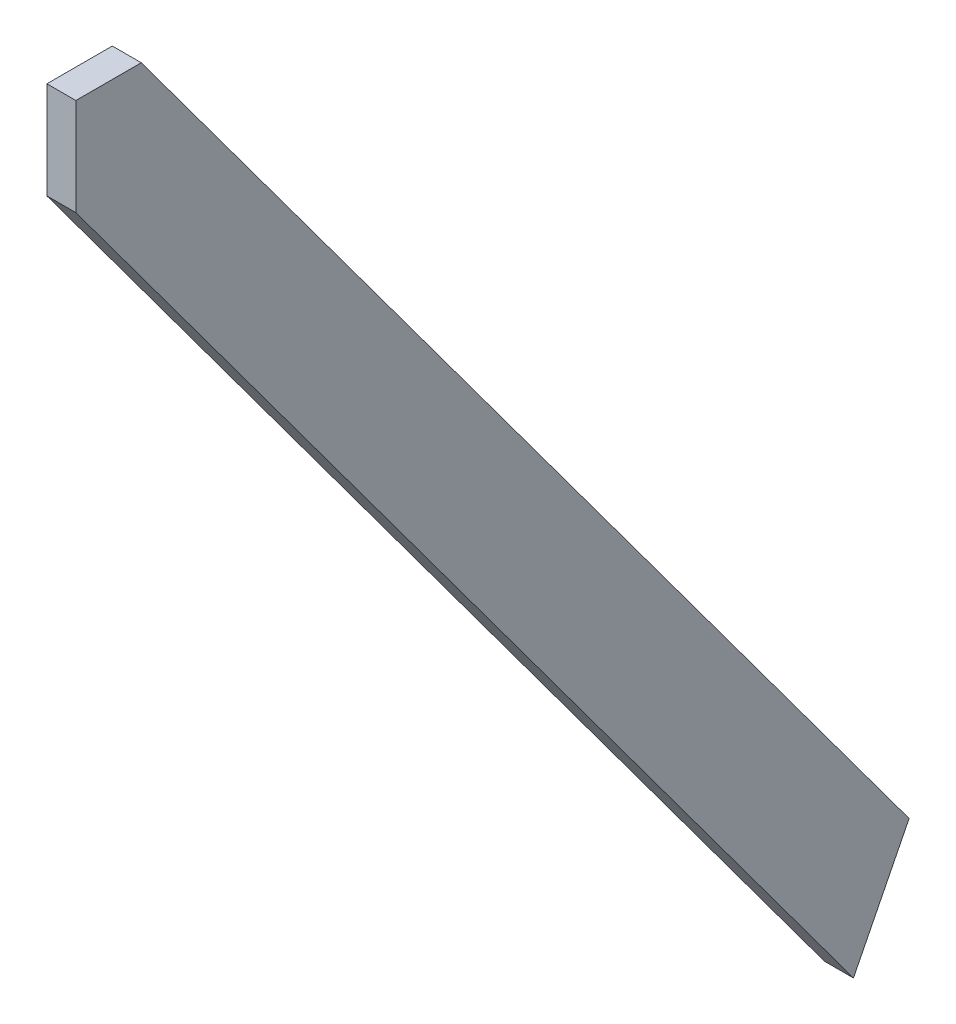
ISO-10303-21;
HEADER;
FILE_DESCRIPTION(('STEP AP214'),'2;1');
FILE_NAME('part.step','',(''),(''),'','','');
FILE_SCHEMA(('AUTOMOTIVE_DESIGN { 1 0 10303 214 1 1 1 1 }'));
ENDSEC;
DATA;
#1=APPLICATION_CONTEXT('core data for automotive mechanical design processes');
#2=APPLICATION_PROTOCOL_DEFINITION('international standard','automotive_design',2000,#1);
#3=PRODUCT_CONTEXT('',#1,'mechanical');
#4=PRODUCT('Part','Part','',(#3));
#5=PRODUCT_RELATED_PRODUCT_CATEGORY('part','',(#4));
#6=PRODUCT_DEFINITION_FORMATION('','',#4);
#7=PRODUCT_DEFINITION_CONTEXT('part definition',#1,'design');
#8=PRODUCT_DEFINITION('design','',#6,#7);
#9=PRODUCT_DEFINITION_SHAPE('','',#8);
#10=(LENGTH_UNIT() NAMED_UNIT(*) SI_UNIT(.MILLI.,.METRE.));
#11=(NAMED_UNIT(*) PLANE_ANGLE_UNIT() SI_UNIT($,.RADIAN.));
#12=(NAMED_UNIT(*) SI_UNIT($,.STERADIAN.) SOLID_ANGLE_UNIT());
#13=UNCERTAINTY_MEASURE_WITH_UNIT(LENGTH_MEASURE(1.E-05),#10,'distance_accuracy_value','');
#14=(GEOMETRIC_REPRESENTATION_CONTEXT(3) GLOBAL_UNCERTAINTY_ASSIGNED_CONTEXT((#13)) GLOBAL_UNIT_ASSIGNED_CONTEXT((#10,
#11,#12)) REPRESENTATION_CONTEXT('',''));
#15=CARTESIAN_POINT('',(0.,0.,0.));
#16=DIRECTION('',(0.,0.,1.));
#17=DIRECTION('',(1.,0.,0.));
#18=AXIS2_PLACEMENT_3D('',#15,#16,#17);
#19=CARTESIAN_POINT('',(2248.,2938.0811721534,2207.85848628738));
#20=DIRECTION('',(0.,-0.594550044513907,0.804058607670182));
#21=DIRECTION('',(0.,-0.804058607670182,-0.594550044513907));
#22=AXIS2_PLACEMENT_3D('',#19,#20,#21);
#23=PLANE('',#22);
#24=CARTESIAN_POINT('',(2269.,2654.039,1997.8274207816));
#25=CARTESIAN_POINT('',(2285.,2654.039,1997.8274207816));
#26=CARTESIAN_POINT('',(2285.,2670.039,2009.65840004291));
#27=CARTESIAN_POINT('',(2269.,2670.039,2009.65840004291));
#28=CARTESIAN_POINT('',(2253.,2670.039,2009.65840004291));
#29=CARTESIAN_POINT('',(2253.,2654.039,1997.8274207816));
#30=CARTESIAN_POINT('',(2269.,2654.039,1997.8274207816));
#31=(BOUNDED_CURVE() B_SPLINE_CURVE(3,(#24,#25,#26,#27,#28,#29,#30),.UNSPECIFIED.,.T.,
.F.) B_SPLINE_CURVE_WITH_KNOTS((4,3,4),(0.,0.5,1.),
.UNSPECIFIED.) CURVE() GEOMETRIC_REPRESENTATION_ITEM() RATIONAL_B_SPLINE_CURVE((1.,
0.333333333333333,0.333333333333333,1.,0.333333333333333,0.333333333333333,1.)) REPRESENTATION_ITEM(''));
#32=CARTESIAN_POINT('',(2269.,2654.039,1997.8274207816));
#33=VERTEX_POINT('',#32);
#34=EDGE_CURVE('E138',#33,#33,#31,.T.);
#35=ORIENTED_EDGE('',*,*,#34,.T.);
#36=EDGE_LOOP('',(#35));
#37=FACE_BOUND('',#36,.T.);
#38=CARTESIAN_POINT('',(2269.,2546.014,1917.94982486327));
#39=CARTESIAN_POINT('',(2285.,2546.014,1917.94982486327));
#40=CARTESIAN_POINT('',(2285.,2562.014,1929.78080412458));
#41=CARTESIAN_POINT('',(2269.,2562.014,1929.78080412458));
#42=CARTESIAN_POINT('',(2253.,2562.014,1929.78080412458));
#43=CARTESIAN_POINT('',(2253.,2546.014,1917.94982486327));
#44=CARTESIAN_POINT('',(2269.,2546.014,1917.94982486327));
#45=(BOUNDED_CURVE() B_SPLINE_CURVE(3,(#38,#39,#40,#41,#42,#43,#44),.UNSPECIFIED.,.T.,
.F.) B_SPLINE_CURVE_WITH_KNOTS((4,3,4),(0.,0.5,1.),
.UNSPECIFIED.) CURVE() GEOMETRIC_REPRESENTATION_ITEM() RATIONAL_B_SPLINE_CURVE((1.,
0.333333333333333,0.333333333333333,1.,0.333333333333333,0.333333333333333,1.)) REPRESENTATION_ITEM(''));
#46=CARTESIAN_POINT('',(2269.,2546.014,1917.94982486327));
#47=VERTEX_POINT('',#46);
#48=EDGE_CURVE('E256',#47,#47,#45,.T.);
#49=ORIENTED_EDGE('',*,*,#48,.T.);
#50=EDGE_LOOP('',(#49));
#51=FACE_BOUND('',#50,.T.);
#52=CARTESIAN_POINT('',(2269.,2419.4092,1824.33365216467));
#53=CARTESIAN_POINT('',(2285.,2419.4092,1824.33365216467));
#54=CARTESIAN_POINT('',(2285.,2435.4092,1836.16463142597));
#55=CARTESIAN_POINT('',(2269.,2435.4092,1836.16463142597));
#56=CARTESIAN_POINT('',(2253.,2435.4092,1836.16463142597));
#57=CARTESIAN_POINT('',(2253.,2419.4092,1824.33365216467));
#58=CARTESIAN_POINT('',(2269.,2419.4092,1824.33365216467));
#59=(BOUNDED_CURVE() B_SPLINE_CURVE(3,(#52,#53,#54,#55,#56,#57,#58),.UNSPECIFIED.,.T.,
.F.) B_SPLINE_CURVE_WITH_KNOTS((4,3,4),(0.,0.5,1.),
.UNSPECIFIED.) CURVE() GEOMETRIC_REPRESENTATION_ITEM() RATIONAL_B_SPLINE_CURVE((1.,
0.333333333333333,0.333333333333333,1.,0.333333333333333,0.333333333333333,1.)) REPRESENTATION_ITEM(''));
#60=CARTESIAN_POINT('',(2269.,2419.4092,1824.33365216467));
#61=VERTEX_POINT('',#60);
#62=EDGE_CURVE('E285',#61,#61,#59,.T.);
#63=ORIENTED_EDGE('',*,*,#62,.T.);
#64=EDGE_LOOP('',(#63));
#65=FACE_BOUND('',#64,.T.);
#66=CARTESIAN_POINT('',(2269.,2292.67805,1730.62405170104));
#67=CARTESIAN_POINT('',(2285.,2292.67805,1730.62405170104));
#68=CARTESIAN_POINT('',(2285.,2308.67805,1742.45503096235));
#69=CARTESIAN_POINT('',(2269.,2308.67805,1742.45503096235));
#70=CARTESIAN_POINT('',(2253.,2308.67805,1742.45503096235));
#71=CARTESIAN_POINT('',(2253.,2292.67805,1730.62405170104));
#72=CARTESIAN_POINT('',(2269.,2292.67805,1730.62405170104));
#73=(BOUNDED_CURVE() B_SPLINE_CURVE(3,(#66,#67,#68,#69,#70,#71,#72),.UNSPECIFIED.,.T.,
.F.) B_SPLINE_CURVE_WITH_KNOTS((4,3,4),(0.,0.5,1.),
.UNSPECIFIED.) CURVE() GEOMETRIC_REPRESENTATION_ITEM() RATIONAL_B_SPLINE_CURVE((1.,
0.333333333333333,0.333333333333333,1.,0.333333333333333,0.333333333333333,1.)) REPRESENTATION_ITEM(''));
#74=CARTESIAN_POINT('',(2269.,2292.67805,1730.62405170104));
#75=VERTEX_POINT('',#74);
#76=EDGE_CURVE('E303',#75,#75,#73,.T.);
#77=ORIENTED_EDGE('',*,*,#76,.T.);
#78=EDGE_LOOP('',(#77));
#79=FACE_BOUND('',#78,.T.);
#80=CARTESIAN_POINT('',(2269.,2166.07315,1637.0078050587));
#81=CARTESIAN_POINT('',(2285.,2166.07315,1637.0078050587));
#82=CARTESIAN_POINT('',(2285.,2182.07315,1648.83878432001));
#83=CARTESIAN_POINT('',(2269.,2182.07315,1648.83878432001));
#84=CARTESIAN_POINT('',(2253.,2182.07315,1648.83878432001));
#85=CARTESIAN_POINT('',(2253.,2166.07315,1637.0078050587));
#86=CARTESIAN_POINT('',(2269.,2166.07315,1637.0078050587));
#87=(BOUNDED_CURVE() B_SPLINE_CURVE(3,(#80,#81,#82,#83,#84,#85,#86),.UNSPECIFIED.,.T.,
.F.) B_SPLINE_CURVE_WITH_KNOTS((4,3,4),(0.,0.5,1.),
.UNSPECIFIED.) CURVE() GEOMETRIC_REPRESENTATION_ITEM() RATIONAL_B_SPLINE_CURVE((1.,
0.333333333333333,0.333333333333333,1.,0.333333333333333,0.333333333333333,1.)) REPRESENTATION_ITEM(''));
#88=CARTESIAN_POINT('',(2269.,2166.07315,1637.0078050587));
#89=VERTEX_POINT('',#88);
#90=EDGE_CURVE('E319',#89,#89,#87,.T.);
#91=ORIENTED_EDGE('',*,*,#90,.T.);
#92=EDGE_LOOP('',(#91));
#93=FACE_BOUND('',#92,.T.);
#94=CARTESIAN_POINT('',(2269.,2039.3422,1543.29835248255));
#95=CARTESIAN_POINT('',(2285.,2039.3422,1543.29835248255));
#96=CARTESIAN_POINT('',(2285.,2055.3422,1555.12933174386));
#97=CARTESIAN_POINT('',(2269.,2055.3422,1555.12933174386));
#98=CARTESIAN_POINT('',(2253.,2055.3422,1555.12933174386));
#99=CARTESIAN_POINT('',(2253.,2039.3422,1543.29835248255));
#100=CARTESIAN_POINT('',(2269.,2039.3422,1543.29835248255));
#101=(BOUNDED_CURVE() B_SPLINE_CURVE(3,(#94,#95,#96,#97,#98,#99,#100),.UNSPECIFIED.,.T.,
.F.) B_SPLINE_CURVE_WITH_KNOTS((4,3,4),(0.,0.5,1.),
.UNSPECIFIED.) CURVE() GEOMETRIC_REPRESENTATION_ITEM() RATIONAL_B_SPLINE_CURVE((1.,
0.333333333333333,0.333333333333333,1.,0.333333333333333,0.333333333333333,1.)) REPRESENTATION_ITEM(''));
#102=CARTESIAN_POINT('',(2269.,2039.3422,1543.29835248255));
#103=VERTEX_POINT('',#102);
#104=EDGE_CURVE('E335',#103,#103,#101,.T.);
#105=ORIENTED_EDGE('',*,*,#104,.T.);
#106=EDGE_LOOP('',(#105));
#107=FACE_BOUND('',#106,.T.);
#108=CARTESIAN_POINT('',(2269.,1912.7371,1449.68195795273));
#109=CARTESIAN_POINT('',(2285.,1912.7371,1449.68195795273));
#110=CARTESIAN_POINT('',(2285.,1928.7371,1461.51293721404));
#111=CARTESIAN_POINT('',(2269.,1928.7371,1461.51293721404));
#112=CARTESIAN_POINT('',(2253.,1928.7371,1461.51293721404));
#113=CARTESIAN_POINT('',(2253.,1912.7371,1449.68195795273));
#114=CARTESIAN_POINT('',(2269.,1912.7371,1449.68195795273));
#115=(BOUNDED_CURVE() B_SPLINE_CURVE(3,(#108,#109,#110,#111,#112,#113,#114),.UNSPECIFIED.,.T.,
.F.) B_SPLINE_CURVE_WITH_KNOTS((4,3,4),(0.,0.5,1.),
.UNSPECIFIED.) CURVE() GEOMETRIC_REPRESENTATION_ITEM() RATIONAL_B_SPLINE_CURVE((1.,
0.333333333333333,0.333333333333333,1.,0.333333333333333,0.333333333333333,1.)) REPRESENTATION_ITEM(''));
#116=CARTESIAN_POINT('',(2269.,1912.7371,1449.68195795273));
#117=VERTEX_POINT('',#116);
#118=EDGE_CURVE('E351',#117,#117,#115,.T.);
#119=ORIENTED_EDGE('',*,*,#118,.T.);
#120=EDGE_LOOP('',(#119));
#121=FACE_BOUND('',#120,.T.);
#122=CARTESIAN_POINT('',(2269.,1786.00615,1355.97250537658));
#123=CARTESIAN_POINT('',(2285.,1786.00615,1355.97250537658));
#124=CARTESIAN_POINT('',(2285.,1802.00615,1367.80348463789));
#125=CARTESIAN_POINT('',(2269.,1802.00615,1367.80348463789));
#126=CARTESIAN_POINT('',(2253.,1802.00615,1367.80348463789));
#127=CARTESIAN_POINT('',(2253.,1786.00615,1355.97250537658));
#128=CARTESIAN_POINT('',(2269.,1786.00615,1355.97250537658));
#129=(BOUNDED_CURVE() B_SPLINE_CURVE(3,(#122,#123,#124,#125,#126,#127,#128),.UNSPECIFIED.,.T.,
.F.) B_SPLINE_CURVE_WITH_KNOTS((4,3,4),(0.,0.5,1.),
.UNSPECIFIED.) CURVE() GEOMETRIC_REPRESENTATION_ITEM() RATIONAL_B_SPLINE_CURVE((1.,
0.333333333333333,0.333333333333333,1.,0.333333333333333,0.333333333333333,1.)) REPRESENTATION_ITEM(''));
#130=CARTESIAN_POINT('',(2269.,1786.00615,1355.97250537658));
#131=VERTEX_POINT('',#130);
#132=EDGE_CURVE('E367',#131,#131,#129,.T.);
#133=ORIENTED_EDGE('',*,*,#132,.T.);
#134=EDGE_LOOP('',(#133));
#135=FACE_BOUND('',#134,.T.);
#136=CARTESIAN_POINT('',(2269.,1659.4002,1262.35548232681));
#137=CARTESIAN_POINT('',(2285.,1659.4002,1262.35548232681));
#138=CARTESIAN_POINT('',(2285.,1675.4002,1274.18646158812));
#139=CARTESIAN_POINT('',(2269.,1675.4002,1274.18646158812));
#140=CARTESIAN_POINT('',(2253.,1675.4002,1274.18646158812));
#141=CARTESIAN_POINT('',(2253.,1659.4002,1262.35548232681));
#142=CARTESIAN_POINT('',(2269.,1659.4002,1262.35548232681));
#143=(BOUNDED_CURVE() B_SPLINE_CURVE(3,(#136,#137,#138,#139,#140,#141,#142),.UNSPECIFIED.,.T.,
.F.) B_SPLINE_CURVE_WITH_KNOTS((4,3,4),(0.,0.5,1.),
.UNSPECIFIED.) CURVE() GEOMETRIC_REPRESENTATION_ITEM() RATIONAL_B_SPLINE_CURVE((1.,
0.333333333333333,0.333333333333333,1.,0.333333333333333,0.333333333333333,1.)) REPRESENTATION_ITEM(''));
#144=CARTESIAN_POINT('',(2269.,1659.4002,1262.35548232681));
#145=VERTEX_POINT('',#144);
#146=EDGE_CURVE('E383',#145,#145,#143,.T.);
#147=ORIENTED_EDGE('',*,*,#146,.T.);
#148=EDGE_LOOP('',(#147));
#149=FACE_BOUND('',#148,.T.);
#150=CARTESIAN_POINT('',(2269.,1532.66905,1168.64588186318));
#151=CARTESIAN_POINT('',(2285.,1532.66905,1168.64588186318));
#152=CARTESIAN_POINT('',(2285.,1548.66905,1180.47686112449));
#153=CARTESIAN_POINT('',(2269.,1548.66905,1180.47686112449));
#154=CARTESIAN_POINT('',(2253.,1548.66905,1180.47686112449));
#155=CARTESIAN_POINT('',(2253.,1532.66905,1168.64588186318));
#156=CARTESIAN_POINT('',(2269.,1532.66905,1168.64588186318));
#157=(BOUNDED_CURVE() B_SPLINE_CURVE(3,(#150,#151,#152,#153,#154,#155,#156),.UNSPECIFIED.,.T.,
.F.) B_SPLINE_CURVE_WITH_KNOTS((4,3,4),(0.,0.5,1.),
.UNSPECIFIED.) CURVE() GEOMETRIC_REPRESENTATION_ITEM() RATIONAL_B_SPLINE_CURVE((1.,
0.333333333333333,0.333333333333333,1.,0.333333333333333,0.333333333333333,1.)) REPRESENTATION_ITEM(''));
#158=CARTESIAN_POINT('',(2269.,1532.66905,1168.64588186318));
#159=VERTEX_POINT('',#158);
#160=EDGE_CURVE('E399',#159,#159,#157,.T.);
#161=ORIENTED_EDGE('',*,*,#160,.T.);
#162=EDGE_LOOP('',(#161));
#163=FACE_BOUND('',#162,.T.);
#164=DIRECTION('',(0.,-0.804058607670182,-0.594550044513907));
#165=VECTOR('',#164,1.);
#166=CARTESIAN_POINT('',(2290.,2938.0811721534,2207.85848628738));
#167=LINE('',#166,#165);
#168=CARTESIAN_POINT('',(2290.,2938.0811721534,2207.85848628738));
#169=VERTEX_POINT('',#168);
#170=CARTESIAN_POINT('',(2290.,1432.3329,1094.4537));
#171=VERTEX_POINT('',#170);
#172=EDGE_CURVE('E123',#169,#171,#167,.T.);
#173=ORIENTED_EDGE('',*,*,#172,.T.);
#174=DIRECTION('',(1.,0.,0.));
#175=VECTOR('',#174,1.);
#176=CARTESIAN_POINT('',(2248.,1432.3329,1094.4537));
#177=LINE('',#176,#175);
#178=CARTESIAN_POINT('',(2248.,1432.3329,1094.4537));
#179=VERTEX_POINT('',#178);
#180=EDGE_CURVE('E11',#179,#171,#177,.T.);
#181=ORIENTED_EDGE('',*,*,#180,.F.);
#182=DIRECTION('',(0.,-0.804058607670182,-0.594550044513907));
#183=VECTOR('',#182,1.);
#184=CARTESIAN_POINT('',(2248.,2938.0811721534,2207.85848628738));
#185=LINE('',#184,#183);
#186=CARTESIAN_POINT('',(2248.,2938.0811721534,2207.85848628738));
#187=VERTEX_POINT('',#186);
#188=EDGE_CURVE('E119',#187,#179,#185,.T.);
#189=ORIENTED_EDGE('',*,*,#188,.F.);
#190=DIRECTION('',(1.,0.,0.));
#191=VECTOR('',#190,1.);
#192=CARTESIAN_POINT('',(2248.,2938.0811721534,2207.85848628738));
#193=LINE('',#192,#191);
#194=EDGE_CURVE('E116',#187,#169,#193,.T.);
#195=ORIENTED_EDGE('',*,*,#194,.T.);
#196=EDGE_LOOP('',(#173,#181,#189,#195));
#197=FACE_BOUND('',#196,.T.);
#198=ADVANCED_FACE('F40',(#37,#51,#65,#79,#93,#107,#121,#135,#149,#163,#197),#23,.F.);
#199=CARTESIAN_POINT('',(2248.,1432.3329,1094.4537));
#200=DIRECTION('',(0.,0.450251342651816,0.892901858235404));
#201=DIRECTION('',(0.,-0.892901858235404,0.450251342651816));
#202=AXIS2_PLACEMENT_3D('',#199,#200,#201);
#203=PLANE('',#202);
#204=DIRECTION('',(0.,-0.892901858235404,0.450251342651816));
#205=VECTOR('',#204,1.);
#206=CARTESIAN_POINT('',(2290.,1432.3329,1094.4537));
#207=LINE('',#206,#205);
#208=CARTESIAN_POINT('',(2290.,1272.3329,1175.1347));
#209=VERTEX_POINT('',#208);
#210=EDGE_CURVE('E127',#171,#209,#207,.T.);
#211=ORIENTED_EDGE('',*,*,#210,.T.);
#212=DIRECTION('',(1.,0.,0.));
#213=VECTOR('',#212,1.);
#214=CARTESIAN_POINT('',(2248.,1272.3329,1175.1347));
#215=LINE('',#214,#213);
#216=CARTESIAN_POINT('',(2248.,1272.3329,1175.1347));
#217=VERTEX_POINT('',#216);
#218=EDGE_CURVE('E48',#217,#209,#215,.T.);
#219=ORIENTED_EDGE('',*,*,#218,.F.);
#220=DIRECTION('',(0.,-0.892901858235404,0.450251342651816));
#221=VECTOR('',#220,1.);
#222=CARTESIAN_POINT('',(2248.,1432.3329,1094.4537));
#223=LINE('',#222,#221);
#224=EDGE_CURVE('E89',#179,#217,#223,.T.);
#225=ORIENTED_EDGE('',*,*,#224,.F.);
#226=ORIENTED_EDGE('',*,*,#180,.T.);
#227=EDGE_LOOP('',(#211,#219,#225,#226));
#228=FACE_BOUND('',#227,.T.);
#229=ADVANCED_FACE('F148',(#228),#203,.F.);
#230=CARTESIAN_POINT('',(2248.,1272.3329,1175.1347));
#231=DIRECTION('',(0.,0.594550011892989,-0.804058631791268));
#232=DIRECTION('',(0.,0.804058631791269,0.594550011892989));
#233=AXIS2_PLACEMENT_3D('',#230,#231,#232);
#234=PLANE('',#233);
#235=DIRECTION('',(0.,0.804058631791269,0.594550011892989));
#236=VECTOR('',#235,1.);
#237=CARTESIAN_POINT('',(2290.,1272.3329,1175.1347));
#238=LINE('',#237,#236);
#239=CARTESIAN_POINT('',(2290.,2797.2767556717,2302.7333));
#240=VERTEX_POINT('',#239);
#241=EDGE_CURVE('E109',#209,#240,#238,.T.);
#242=ORIENTED_EDGE('',*,*,#241,.T.);
#243=DIRECTION('',(1.,0.,0.));
#244=VECTOR('',#243,1.);
#245=CARTESIAN_POINT('',(2248.,2797.2767556717,2302.7333));
#246=LINE('',#245,#244);
#247=CARTESIAN_POINT('',(2248.,2797.2767556717,2302.7333));
#248=VERTEX_POINT('',#247);
#249=EDGE_CURVE('E55',#248,#240,#246,.T.);
#250=ORIENTED_EDGE('',*,*,#249,.F.);
#251=DIRECTION('',(0.,0.804058631791269,0.594550011892989));
#252=VECTOR('',#251,1.);
#253=CARTESIAN_POINT('',(2248.,1272.3329,1175.1347));
#254=LINE('',#253,#252);
#255=EDGE_CURVE('E107',#217,#248,#254,.T.);
#256=ORIENTED_EDGE('',*,*,#255,.F.);
#257=ORIENTED_EDGE('',*,*,#218,.T.);
#258=EDGE_LOOP('',(#242,#250,#256,#257));
#259=FACE_BOUND('',#258,.T.);
#260=ADVANCED_FACE('F105',(#259),#234,.F.);
#261=CARTESIAN_POINT('',(2248.,2938.0811721534,2207.85848628738));
#262=DIRECTION('',(0.,-1.,0.));
#263=DIRECTION('',(1.,0.,0.));
#264=AXIS2_PLACEMENT_3D('',#261,#262,#263);
#265=PLANE('',#264);
#266=DIRECTION('',(0.,0.,-1.));
#267=VECTOR('',#266,1.);
#268=CARTESIAN_POINT('',(2248.,2938.0811721534,2207.85848628738));
#269=LINE('',#268,#267);
#270=CARTESIAN_POINT('',(2248.,2938.0811721534,2302.7333));
#271=VERTEX_POINT('',#270);
#272=EDGE_CURVE('E64',#271,#187,#269,.T.);
#273=ORIENTED_EDGE('',*,*,#272,.F.);
#274=DIRECTION('',(1.,0.,0.));
#275=VECTOR('',#274,1.);
#276=CARTESIAN_POINT('',(2248.,2938.0811721534,2302.7333));
#277=LINE('',#276,#275);
#278=CARTESIAN_POINT('',(2290.,2938.0811721534,2302.7333));
#279=VERTEX_POINT('',#278);
#280=EDGE_CURVE('E98',#271,#279,#277,.T.);
#281=ORIENTED_EDGE('',*,*,#280,.T.);
#282=DIRECTION('',(0.,0.,-1.));
#283=VECTOR('',#282,1.);
#284=CARTESIAN_POINT('',(2290.,2938.0811721534,2207.85848628738));
#285=LINE('',#284,#283);
#286=EDGE_CURVE('E83',#279,#169,#285,.T.);
#287=ORIENTED_EDGE('',*,*,#286,.T.);
#288=ORIENTED_EDGE('',*,*,#194,.F.);
#289=EDGE_LOOP('',(#273,#281,#287,#288));
#290=FACE_BOUND('',#289,.T.);
#291=ADVANCED_FACE('F155',(#290),#265,.F.);
#292=CARTESIAN_POINT('',(2248.,0.,0.));
#293=DIRECTION('',(-1.,0.,0.));
#294=DIRECTION('',(0.,0.,1.));
#295=AXIS2_PLACEMENT_3D('',#292,#293,#294);
#296=PLANE('',#295);
#297=DIRECTION('',(0.,1.,0.));
#298=VECTOR('',#297,1.);
#299=CARTESIAN_POINT('',(2248.,2797.2767556717,2302.7333));
#300=LINE('',#299,#298);
#301=EDGE_CURVE('E96',#248,#271,#300,.T.);
#302=ORIENTED_EDGE('',*,*,#301,.T.);
#303=ORIENTED_EDGE('',*,*,#272,.T.);
#304=ORIENTED_EDGE('',*,*,#188,.T.);
#305=ORIENTED_EDGE('',*,*,#224,.T.);
#306=ORIENTED_EDGE('',*,*,#255,.T.);
#307=EDGE_LOOP('',(#302,#303,#304,#305,#306));
#308=FACE_BOUND('',#307,.T.);
#309=ADVANCED_FACE('F111',(#308),#296,.T.);
#310=CARTESIAN_POINT('',(2290.,0.,0.));
#311=DIRECTION('',(-1.,0.,0.));
#312=DIRECTION('',(0.,0.,1.));
#313=AXIS2_PLACEMENT_3D('',#310,#311,#312);
#314=PLANE('',#313);
#315=ORIENTED_EDGE('',*,*,#286,.F.);
#316=DIRECTION('',(0.,1.,0.));
#317=VECTOR('',#316,1.);
#318=CARTESIAN_POINT('',(2290.,2797.2767556717,2302.7333));
#319=LINE('',#318,#317);
#320=EDGE_CURVE('E100',#240,#279,#319,.T.);
#321=ORIENTED_EDGE('',*,*,#320,.F.);
#322=ORIENTED_EDGE('',*,*,#241,.F.);
#323=ORIENTED_EDGE('',*,*,#210,.F.);
#324=ORIENTED_EDGE('',*,*,#172,.F.);
#325=EDGE_LOOP('',(#315,#321,#322,#323,#324));
#326=FACE_BOUND('',#325,.T.);
#327=ADVANCED_FACE('F133',(#326),#314,.F.);
#328=CARTESIAN_POINT('',(2248.,2797.2767556717,2302.7333));
#329=DIRECTION('',(0.,0.,-1.));
#330=DIRECTION('',(-1.,0.,0.));
#331=AXIS2_PLACEMENT_3D('',#328,#329,#330);
#332=PLANE('',#331);
#333=ORIENTED_EDGE('',*,*,#320,.T.);
#334=ORIENTED_EDGE('',*,*,#280,.F.);
#335=ORIENTED_EDGE('',*,*,#301,.F.);
#336=ORIENTED_EDGE('',*,*,#249,.T.);
#337=EDGE_LOOP('',(#333,#334,#335,#336));
#338=FACE_BOUND('',#337,.T.);
#339=ADVANCED_FACE('F97',(#338),#332,.F.);
#340=CARTESIAN_POINT('',(2269.,1540.66905,1208.64588186318));
#341=DIRECTION('',(0.,0.,-1.));
#342=DIRECTION('',(-1.,0.,0.));
#343=AXIS2_PLACEMENT_3D('',#340,#341,#342);
#344=CYLINDRICAL_SURFACE('',#343,8.00000000000001);
#345=CARTESIAN_POINT('',(2269.,1532.66905,1208.64588186318));
#346=CARTESIAN_POINT('',(2285.,1532.66905,1208.64588186318));
#347=CARTESIAN_POINT('',(2285.,1548.66905,1220.47686112449));
#348=CARTESIAN_POINT('',(2269.,1548.66905,1220.47686112449));
#349=CARTESIAN_POINT('',(2253.,1548.66905,1220.47686112449));
#350=CARTESIAN_POINT('',(2253.,1532.66905,1208.64588186318));
#351=CARTESIAN_POINT('',(2269.,1532.66905,1208.64588186318));
#352=(BOUNDED_CURVE() B_SPLINE_CURVE(3,(#345,#346,#347,#348,#349,#350,#351),.UNSPECIFIED.,.T.,
.F.) B_SPLINE_CURVE_WITH_KNOTS((4,3,4),(0.,0.5,1.),
.UNSPECIFIED.) CURVE() GEOMETRIC_REPRESENTATION_ITEM() RATIONAL_B_SPLINE_CURVE((1.,
0.333333333333333,0.333333333333333,1.,0.333333333333333,0.333333333333333,1.)) REPRESENTATION_ITEM(''));
#353=CARTESIAN_POINT('',(2269.,1532.66905,1208.64588186318));
#354=VERTEX_POINT('',#353);
#355=EDGE_CURVE('E392',#354,#354,#352,.T.);
#356=ORIENTED_EDGE('',*,*,#355,.T.);
#357=EDGE_LOOP('',(#356));
#358=FACE_BOUND('',#357,.T.);
#359=ORIENTED_EDGE('',*,*,#160,.F.);
#360=EDGE_LOOP('',(#359));
#361=FACE_BOUND('',#360,.T.);
#362=ADVANCED_FACE('F168',(#358,#361),#344,.F.);
#363=CARTESIAN_POINT('',(2269.,1548.66905,1220.47686112449));
#364=DIRECTION('',(0.,0.594550044513899,-0.804058607670188));
#365=DIRECTION('',(0.,0.804058607670188,0.594550044513899));
#366=AXIS2_PLACEMENT_3D('',#363,#364,#365);
#367=PLANE('',#366);
#368=ORIENTED_EDGE('',*,*,#355,.F.);
#369=EDGE_LOOP('',(#368));
#370=FACE_BOUND('',#369,.T.);
#371=ADVANCED_FACE('F171',(#370),#367,.T.);
#372=CARTESIAN_POINT('',(2269.,1667.4002,1302.35548232681));
#373=DIRECTION('',(0.,0.,-1.));
#374=DIRECTION('',(-1.,0.,0.));
#375=AXIS2_PLACEMENT_3D('',#372,#373,#374);
#376=CYLINDRICAL_SURFACE('',#375,8.00000000000001);
#377=CARTESIAN_POINT('',(2269.,1659.4002,1302.35548232681));
#378=CARTESIAN_POINT('',(2285.,1659.4002,1302.35548232681));
#379=CARTESIAN_POINT('',(2285.,1675.4002,1314.18646158812));
#380=CARTESIAN_POINT('',(2269.,1675.4002,1314.18646158812));
#381=CARTESIAN_POINT('',(2253.,1675.4002,1314.18646158812));
#382=CARTESIAN_POINT('',(2253.,1659.4002,1302.35548232681));
#383=CARTESIAN_POINT('',(2269.,1659.4002,1302.35548232681));
#384=(BOUNDED_CURVE() B_SPLINE_CURVE(3,(#377,#378,#379,#380,#381,#382,#383),.UNSPECIFIED.,.T.,
.F.) B_SPLINE_CURVE_WITH_KNOTS((4,3,4),(0.,0.5,1.),
.UNSPECIFIED.) CURVE() GEOMETRIC_REPRESENTATION_ITEM() RATIONAL_B_SPLINE_CURVE((1.,
0.333333333333333,0.333333333333333,1.,0.333333333333333,0.333333333333333,1.)) REPRESENTATION_ITEM(''));
#385=CARTESIAN_POINT('',(2269.,1659.4002,1302.35548232681));
#386=VERTEX_POINT('',#385);
#387=EDGE_CURVE('E375',#386,#386,#384,.T.);
#388=ORIENTED_EDGE('',*,*,#387,.T.);
#389=EDGE_LOOP('',(#388));
#390=FACE_BOUND('',#389,.T.);
#391=ORIENTED_EDGE('',*,*,#146,.F.);
#392=EDGE_LOOP('',(#391));
#393=FACE_BOUND('',#392,.T.);
#394=ADVANCED_FACE('F175',(#390,#393),#376,.F.);
#395=CARTESIAN_POINT('',(2269.,1675.4002,1314.18646158812));
#396=DIRECTION('',(0.,0.594550044513899,-0.804058607670188));
#397=DIRECTION('',(0.,0.804058607670188,0.594550044513899));
#398=AXIS2_PLACEMENT_3D('',#395,#396,#397);
#399=PLANE('',#398);
#400=ORIENTED_EDGE('',*,*,#387,.F.);
#401=EDGE_LOOP('',(#400));
#402=FACE_BOUND('',#401,.T.);
#403=ADVANCED_FACE('F179',(#402),#399,.T.);
#404=CARTESIAN_POINT('',(2269.,1794.00615,1395.97250537658));
#405=DIRECTION('',(0.,0.,-1.));
#406=DIRECTION('',(-1.,0.,0.));
#407=AXIS2_PLACEMENT_3D('',#404,#405,#406);
#408=CYLINDRICAL_SURFACE('',#407,8.00000000000001);
#409=CARTESIAN_POINT('',(2269.,1786.00615,1395.97250537658));
#410=CARTESIAN_POINT('',(2285.,1786.00615,1395.97250537658));
#411=CARTESIAN_POINT('',(2285.,1802.00615,1407.80348463789));
#412=CARTESIAN_POINT('',(2269.,1802.00615,1407.80348463789));
#413=CARTESIAN_POINT('',(2253.,1802.00615,1407.80348463789));
#414=CARTESIAN_POINT('',(2253.,1786.00615,1395.97250537658));
#415=CARTESIAN_POINT('',(2269.,1786.00615,1395.97250537658));
#416=(BOUNDED_CURVE() B_SPLINE_CURVE(3,(#409,#410,#411,#412,#413,#414,#415),.UNSPECIFIED.,.T.,
.F.) B_SPLINE_CURVE_WITH_KNOTS((4,3,4),(0.,0.5,1.),
.UNSPECIFIED.) CURVE() GEOMETRIC_REPRESENTATION_ITEM() RATIONAL_B_SPLINE_CURVE((1.,
0.333333333333333,0.333333333333333,1.,0.333333333333333,0.333333333333333,1.)) REPRESENTATION_ITEM(''));
#417=CARTESIAN_POINT('',(2269.,1786.00615,1395.97250537658));
#418=VERTEX_POINT('',#417);
#419=EDGE_CURVE('E359',#418,#418,#416,.T.);
#420=ORIENTED_EDGE('',*,*,#419,.T.);
#421=EDGE_LOOP('',(#420));
#422=FACE_BOUND('',#421,.T.);
#423=ORIENTED_EDGE('',*,*,#132,.F.);
#424=EDGE_LOOP('',(#423));
#425=FACE_BOUND('',#424,.T.);
#426=ADVANCED_FACE('F183',(#422,#425),#408,.F.);
#427=CARTESIAN_POINT('',(2269.,1802.00615,1407.80348463789));
#428=DIRECTION('',(0.,0.594550044513894,-0.804058607670192));
#429=DIRECTION('',(0.,0.804058607670192,0.594550044513894));
#430=AXIS2_PLACEMENT_3D('',#427,#428,#429);
#431=PLANE('',#430);
#432=ORIENTED_EDGE('',*,*,#419,.F.);
#433=EDGE_LOOP('',(#432));
#434=FACE_BOUND('',#433,.T.);
#435=ADVANCED_FACE('F187',(#434),#431,.T.);
#436=CARTESIAN_POINT('',(2269.,1920.7371,1489.68195795273));
#437=DIRECTION('',(0.,0.,-1.));
#438=DIRECTION('',(-1.,0.,0.));
#439=AXIS2_PLACEMENT_3D('',#436,#437,#438);
#440=CYLINDRICAL_SURFACE('',#439,8.00000000000001);
#441=CARTESIAN_POINT('',(2269.,1912.7371,1489.68195795273));
#442=CARTESIAN_POINT('',(2285.,1912.7371,1489.68195795273));
#443=CARTESIAN_POINT('',(2285.,1928.7371,1501.51293721404));
#444=CARTESIAN_POINT('',(2269.,1928.7371,1501.51293721404));
#445=CARTESIAN_POINT('',(2253.,1928.7371,1501.51293721404));
#446=CARTESIAN_POINT('',(2253.,1912.7371,1489.68195795273));
#447=CARTESIAN_POINT('',(2269.,1912.7371,1489.68195795273));
#448=(BOUNDED_CURVE() B_SPLINE_CURVE(3,(#441,#442,#443,#444,#445,#446,#447),.UNSPECIFIED.,.T.,
.F.) B_SPLINE_CURVE_WITH_KNOTS((4,3,4),(0.,0.5,1.),
.UNSPECIFIED.) CURVE() GEOMETRIC_REPRESENTATION_ITEM() RATIONAL_B_SPLINE_CURVE((1.,
0.333333333333333,0.333333333333333,1.,0.333333333333333,0.333333333333333,1.)) REPRESENTATION_ITEM(''));
#449=CARTESIAN_POINT('',(2269.,1912.7371,1489.68195795273));
#450=VERTEX_POINT('',#449);
#451=EDGE_CURVE('E343',#450,#450,#448,.T.);
#452=ORIENTED_EDGE('',*,*,#451,.T.);
#453=EDGE_LOOP('',(#452));
#454=FACE_BOUND('',#453,.T.);
#455=ORIENTED_EDGE('',*,*,#118,.F.);
#456=EDGE_LOOP('',(#455));
#457=FACE_BOUND('',#456,.T.);
#458=ADVANCED_FACE('F191',(#454,#457),#440,.F.);
#459=CARTESIAN_POINT('',(2269.,1928.7371,1501.51293721404));
#460=DIRECTION('',(0.,0.594550044513894,-0.804058607670192));
#461=DIRECTION('',(0.,0.804058607670192,0.594550044513894));
#462=AXIS2_PLACEMENT_3D('',#459,#460,#461);
#463=PLANE('',#462);
#464=ORIENTED_EDGE('',*,*,#451,.F.);
#465=EDGE_LOOP('',(#464));
#466=FACE_BOUND('',#465,.T.);
#467=ADVANCED_FACE('F195',(#466),#463,.T.);
#468=CARTESIAN_POINT('',(2269.,2047.3422,1583.29835248255));
#469=DIRECTION('',(0.,0.,-1.));
#470=DIRECTION('',(-1.,0.,0.));
#471=AXIS2_PLACEMENT_3D('',#468,#469,#470);
#472=CYLINDRICAL_SURFACE('',#471,8.00000000000001);
#473=CARTESIAN_POINT('',(2269.,2039.3422,1583.29835248255));
#474=CARTESIAN_POINT('',(2285.,2039.3422,1583.29835248255));
#475=CARTESIAN_POINT('',(2285.,2055.3422,1595.12933174386));
#476=CARTESIAN_POINT('',(2269.,2055.3422,1595.12933174386));
#477=CARTESIAN_POINT('',(2253.,2055.3422,1595.12933174386));
#478=CARTESIAN_POINT('',(2253.,2039.3422,1583.29835248255));
#479=CARTESIAN_POINT('',(2269.,2039.3422,1583.29835248255));
#480=(BOUNDED_CURVE() B_SPLINE_CURVE(3,(#473,#474,#475,#476,#477,#478,#479),.UNSPECIFIED.,.T.,
.F.) B_SPLINE_CURVE_WITH_KNOTS((4,3,4),(0.,0.5,1.),
.UNSPECIFIED.) CURVE() GEOMETRIC_REPRESENTATION_ITEM() RATIONAL_B_SPLINE_CURVE((1.,
0.333333333333333,0.333333333333333,1.,0.333333333333333,0.333333333333333,1.)) REPRESENTATION_ITEM(''));
#481=CARTESIAN_POINT('',(2269.,2039.3422,1583.29835248255));
#482=VERTEX_POINT('',#481);
#483=EDGE_CURVE('E327',#482,#482,#480,.T.);
#484=ORIENTED_EDGE('',*,*,#483,.T.);
#485=EDGE_LOOP('',(#484));
#486=FACE_BOUND('',#485,.T.);
#487=ORIENTED_EDGE('',*,*,#104,.F.);
#488=EDGE_LOOP('',(#487));
#489=FACE_BOUND('',#488,.T.);
#490=ADVANCED_FACE('F199',(#486,#489),#472,.F.);
#491=CARTESIAN_POINT('',(2269.,2055.3422,1595.12933174386));
#492=DIRECTION('',(0.,0.594550044513899,-0.804058607670188));
#493=DIRECTION('',(0.,0.804058607670188,0.594550044513899));
#494=AXIS2_PLACEMENT_3D('',#491,#492,#493);
#495=PLANE('',#494);
#496=ORIENTED_EDGE('',*,*,#483,.F.);
#497=EDGE_LOOP('',(#496));
#498=FACE_BOUND('',#497,.T.);
#499=ADVANCED_FACE('F203',(#498),#495,.T.);
#500=CARTESIAN_POINT('',(2269.,2174.07315,1677.0078050587));
#501=DIRECTION('',(0.,0.,-1.));
#502=DIRECTION('',(-1.,0.,0.));
#503=AXIS2_PLACEMENT_3D('',#500,#501,#502);
#504=CYLINDRICAL_SURFACE('',#503,8.00000000000001);
#505=CARTESIAN_POINT('',(2269.,2166.07315,1677.0078050587));
#506=CARTESIAN_POINT('',(2285.,2166.07315,1677.0078050587));
#507=CARTESIAN_POINT('',(2285.,2182.07315,1688.83878432001));
#508=CARTESIAN_POINT('',(2269.,2182.07315,1688.83878432001));
#509=CARTESIAN_POINT('',(2253.,2182.07315,1688.83878432001));
#510=CARTESIAN_POINT('',(2253.,2166.07315,1677.0078050587));
#511=CARTESIAN_POINT('',(2269.,2166.07315,1677.0078050587));
#512=(BOUNDED_CURVE() B_SPLINE_CURVE(3,(#505,#506,#507,#508,#509,#510,#511),.UNSPECIFIED.,.T.,
.F.) B_SPLINE_CURVE_WITH_KNOTS((4,3,4),(0.,0.5,1.),
.UNSPECIFIED.) CURVE() GEOMETRIC_REPRESENTATION_ITEM() RATIONAL_B_SPLINE_CURVE((1.,
0.333333333333333,0.333333333333333,1.,0.333333333333333,0.333333333333333,1.)) REPRESENTATION_ITEM(''));
#513=CARTESIAN_POINT('',(2269.,2166.07315,1677.0078050587));
#514=VERTEX_POINT('',#513);
#515=EDGE_CURVE('E311',#514,#514,#512,.T.);
#516=ORIENTED_EDGE('',*,*,#515,.T.);
#517=EDGE_LOOP('',(#516));
#518=FACE_BOUND('',#517,.T.);
#519=ORIENTED_EDGE('',*,*,#90,.F.);
#520=EDGE_LOOP('',(#519));
#521=FACE_BOUND('',#520,.T.);
#522=ADVANCED_FACE('F207',(#518,#521),#504,.F.);
#523=CARTESIAN_POINT('',(2269.,2182.07315,1688.83878432001));
#524=DIRECTION('',(0.,0.594550044513899,-0.804058607670188));
#525=DIRECTION('',(0.,0.804058607670188,0.594550044513899));
#526=AXIS2_PLACEMENT_3D('',#523,#524,#525);
#527=PLANE('',#526);
#528=ORIENTED_EDGE('',*,*,#515,.F.);
#529=EDGE_LOOP('',(#528));
#530=FACE_BOUND('',#529,.T.);
#531=ADVANCED_FACE('F211',(#530),#527,.T.);
#532=CARTESIAN_POINT('',(2269.,2300.67805,1770.62405170104));
#533=DIRECTION('',(0.,0.,-1.));
#534=DIRECTION('',(-1.,0.,0.));
#535=AXIS2_PLACEMENT_3D('',#532,#533,#534);
#536=CYLINDRICAL_SURFACE('',#535,8.00000000000001);
#537=CARTESIAN_POINT('',(2269.,2292.67805,1770.62405170104));
#538=CARTESIAN_POINT('',(2285.,2292.67805,1770.62405170104));
#539=CARTESIAN_POINT('',(2285.,2308.67805,1782.45503096235));
#540=CARTESIAN_POINT('',(2269.,2308.67805,1782.45503096235));
#541=CARTESIAN_POINT('',(2253.,2308.67805,1782.45503096235));
#542=CARTESIAN_POINT('',(2253.,2292.67805,1770.62405170104));
#543=CARTESIAN_POINT('',(2269.,2292.67805,1770.62405170104));
#544=(BOUNDED_CURVE() B_SPLINE_CURVE(3,(#537,#538,#539,#540,#541,#542,#543),.UNSPECIFIED.,.T.,
.F.) B_SPLINE_CURVE_WITH_KNOTS((4,3,4),(0.,0.5,1.),
.UNSPECIFIED.) CURVE() GEOMETRIC_REPRESENTATION_ITEM() RATIONAL_B_SPLINE_CURVE((1.,
0.333333333333333,0.333333333333333,1.,0.333333333333333,0.333333333333333,1.)) REPRESENTATION_ITEM(''));
#545=CARTESIAN_POINT('',(2269.,2292.67805,1770.62405170104));
#546=VERTEX_POINT('',#545);
#547=EDGE_CURVE('E294',#546,#546,#544,.T.);
#548=ORIENTED_EDGE('',*,*,#547,.T.);
#549=EDGE_LOOP('',(#548));
#550=FACE_BOUND('',#549,.T.);
#551=ORIENTED_EDGE('',*,*,#76,.F.);
#552=EDGE_LOOP('',(#551));
#553=FACE_BOUND('',#552,.T.);
#554=ADVANCED_FACE('F215',(#550,#553),#536,.F.);
#555=CARTESIAN_POINT('',(2269.,2308.67805,1782.45503096235));
#556=DIRECTION('',(0.,0.594550044513899,-0.804058607670188));
#557=DIRECTION('',(0.,0.804058607670188,0.594550044513899));
#558=AXIS2_PLACEMENT_3D('',#555,#556,#557);
#559=PLANE('',#558);
#560=ORIENTED_EDGE('',*,*,#547,.F.);
#561=EDGE_LOOP('',(#560));
#562=FACE_BOUND('',#561,.T.);
#563=ADVANCED_FACE('F219',(#562),#559,.T.);
#564=CARTESIAN_POINT('',(2269.,2427.4092,1864.33365216467));
#565=DIRECTION('',(0.,0.,-1.));
#566=DIRECTION('',(-1.,0.,0.));
#567=AXIS2_PLACEMENT_3D('',#564,#565,#566);
#568=CYLINDRICAL_SURFACE('',#567,8.00000000000001);
#569=CARTESIAN_POINT('',(2269.,2419.4092,1864.33365216467));
#570=CARTESIAN_POINT('',(2285.,2419.4092,1864.33365216467));
#571=CARTESIAN_POINT('',(2285.,2435.4092,1876.16463142597));
#572=CARTESIAN_POINT('',(2269.,2435.4092,1876.16463142597));
#573=CARTESIAN_POINT('',(2253.,2435.4092,1876.16463142597));
#574=CARTESIAN_POINT('',(2253.,2419.4092,1864.33365216467));
#575=CARTESIAN_POINT('',(2269.,2419.4092,1864.33365216467));
#576=(BOUNDED_CURVE() B_SPLINE_CURVE(3,(#569,#570,#571,#572,#573,#574,#575),.UNSPECIFIED.,.T.,
.F.) B_SPLINE_CURVE_WITH_KNOTS((4,3,4),(0.,0.5,1.),
.UNSPECIFIED.) CURVE() GEOMETRIC_REPRESENTATION_ITEM() RATIONAL_B_SPLINE_CURVE((1.,
0.333333333333333,0.333333333333333,1.,0.333333333333333,0.333333333333333,1.)) REPRESENTATION_ITEM(''));
#577=CARTESIAN_POINT('',(2269.,2419.4092,1864.33365216467));
#578=VERTEX_POINT('',#577);
#579=EDGE_CURVE('E276',#578,#578,#576,.T.);
#580=ORIENTED_EDGE('',*,*,#579,.T.);
#581=EDGE_LOOP('',(#580));
#582=FACE_BOUND('',#581,.T.);
#583=ORIENTED_EDGE('',*,*,#62,.F.);
#584=EDGE_LOOP('',(#583));
#585=FACE_BOUND('',#584,.T.);
#586=ADVANCED_FACE('F223',(#582,#585),#568,.F.);
#587=CARTESIAN_POINT('',(2269.,2435.4092,1876.16463142597));
#588=DIRECTION('',(0.,0.594550044513899,-0.804058607670188));
#589=DIRECTION('',(0.,0.804058607670188,0.594550044513899));
#590=AXIS2_PLACEMENT_3D('',#587,#588,#589);
#591=PLANE('',#590);
#592=ORIENTED_EDGE('',*,*,#579,.F.);
#593=EDGE_LOOP('',(#592));
#594=FACE_BOUND('',#593,.T.);
#595=ADVANCED_FACE('F227',(#594),#591,.T.);
#596=CARTESIAN_POINT('',(2269.,2554.014,1957.94982486327));
#597=DIRECTION('',(0.,0.,-1.));
#598=DIRECTION('',(-1.,0.,0.));
#599=AXIS2_PLACEMENT_3D('',#596,#597,#598);
#600=CYLINDRICAL_SURFACE('',#599,8.00000000000001);
#601=CARTESIAN_POINT('',(2269.,2546.014,1957.94982486327));
#602=CARTESIAN_POINT('',(2285.,2546.014,1957.94982486327));
#603=CARTESIAN_POINT('',(2285.,2562.014,1969.78080412458));
#604=CARTESIAN_POINT('',(2269.,2562.014,1969.78080412458));
#605=CARTESIAN_POINT('',(2253.,2562.014,1969.78080412458));
#606=CARTESIAN_POINT('',(2253.,2546.014,1957.94982486327));
#607=CARTESIAN_POINT('',(2269.,2546.014,1957.94982486327));
#608=(BOUNDED_CURVE() B_SPLINE_CURVE(3,(#601,#602,#603,#604,#605,#606,#607),.UNSPECIFIED.,.T.,
.F.) B_SPLINE_CURVE_WITH_KNOTS((4,3,4),(0.,0.5,1.),
.UNSPECIFIED.) CURVE() GEOMETRIC_REPRESENTATION_ITEM() RATIONAL_B_SPLINE_CURVE((1.,
0.333333333333333,0.333333333333333,1.,0.333333333333333,0.333333333333333,1.)) REPRESENTATION_ITEM(''));
#609=CARTESIAN_POINT('',(2269.,2546.014,1957.94982486327));
#610=VERTEX_POINT('',#609);
#611=EDGE_CURVE('E253',#610,#610,#608,.T.);
#612=ORIENTED_EDGE('',*,*,#611,.T.);
#613=EDGE_LOOP('',(#612));
#614=FACE_BOUND('',#613,.T.);
#615=ORIENTED_EDGE('',*,*,#48,.F.);
#616=EDGE_LOOP('',(#615));
#617=FACE_BOUND('',#616,.T.);
#618=ADVANCED_FACE('F231',(#614,#617),#600,.F.);
#619=CARTESIAN_POINT('',(2269.,2562.014,1969.78080412458));
#620=DIRECTION('',(0.,0.594550044513899,-0.804058607670188));
#621=DIRECTION('',(0.,0.804058607670188,0.594550044513899));
#622=AXIS2_PLACEMENT_3D('',#619,#620,#621);
#623=PLANE('',#622);
#624=ORIENTED_EDGE('',*,*,#611,.F.);
#625=EDGE_LOOP('',(#624));
#626=FACE_BOUND('',#625,.T.);
#627=ADVANCED_FACE('F235',(#626),#623,.T.);
#628=CARTESIAN_POINT('',(2269.,2662.039,2037.8274207816));
#629=DIRECTION('',(0.,0.,-1.));
#630=DIRECTION('',(-1.,0.,0.));
#631=AXIS2_PLACEMENT_3D('',#628,#629,#630);
#632=CYLINDRICAL_SURFACE('',#631,8.00000000000001);
#633=CARTESIAN_POINT('',(2269.,2654.039,2037.8274207816));
#634=CARTESIAN_POINT('',(2285.,2654.039,2037.8274207816));
#635=CARTESIAN_POINT('',(2285.,2670.039,2049.65840004291));
#636=CARTESIAN_POINT('',(2269.,2670.039,2049.65840004291));
#637=CARTESIAN_POINT('',(2253.,2670.039,2049.65840004291));
#638=CARTESIAN_POINT('',(2253.,2654.039,2037.8274207816));
#639=CARTESIAN_POINT('',(2269.,2654.039,2037.8274207816));
#640=(BOUNDED_CURVE() B_SPLINE_CURVE(3,(#633,#634,#635,#636,#637,#638,#639),.UNSPECIFIED.,.T.,
.F.) B_SPLINE_CURVE_WITH_KNOTS((4,3,4),(0.,0.5,1.),
.UNSPECIFIED.) CURVE() GEOMETRIC_REPRESENTATION_ITEM() RATIONAL_B_SPLINE_CURVE((1.,
0.333333333333333,0.333333333333333,1.,0.333333333333333,0.333333333333333,1.)) REPRESENTATION_ITEM(''));
#641=CARTESIAN_POINT('',(2269.,2654.039,2037.8274207816));
#642=VERTEX_POINT('',#641);
#643=EDGE_CURVE('E135',#642,#642,#640,.T.);
#644=ORIENTED_EDGE('',*,*,#643,.T.);
#645=EDGE_LOOP('',(#644));
#646=FACE_BOUND('',#645,.T.);
#647=ORIENTED_EDGE('',*,*,#34,.F.);
#648=EDGE_LOOP('',(#647));
#649=FACE_BOUND('',#648,.T.);
#650=ADVANCED_FACE('F239',(#646,#649),#632,.F.);
#651=CARTESIAN_POINT('',(2269.,2670.039,2049.65840004291));
#652=DIRECTION('',(0.,0.594550044513892,-0.804058607670193));
#653=DIRECTION('',(0.,0.804058607670193,0.594550044513892));
#654=AXIS2_PLACEMENT_3D('',#651,#652,#653);
#655=PLANE('',#654);
#656=ORIENTED_EDGE('',*,*,#643,.F.);
#657=EDGE_LOOP('',(#656));
#658=FACE_BOUND('',#657,.T.);
#659=ADVANCED_FACE('F243',(#658),#655,.T.);
#660=CLOSED_SHELL('',(#198,#229,#260,#291,#309,#327,#339,#362,#371,#394,#403,#426,#435,#458,
#467,#490,#499,#522,#531,#554,#563,#586,#595,#618,#627,#650,#659));
#661=MANIFOLD_SOLID_BREP('B2',#660);
#662=ADVANCED_BREP_SHAPE_REPRESENTATION('',(#18,#661),#14);
#663=SHAPE_DEFINITION_REPRESENTATION(#9,#662);
ENDSEC;
END-ISO-10303-21;
